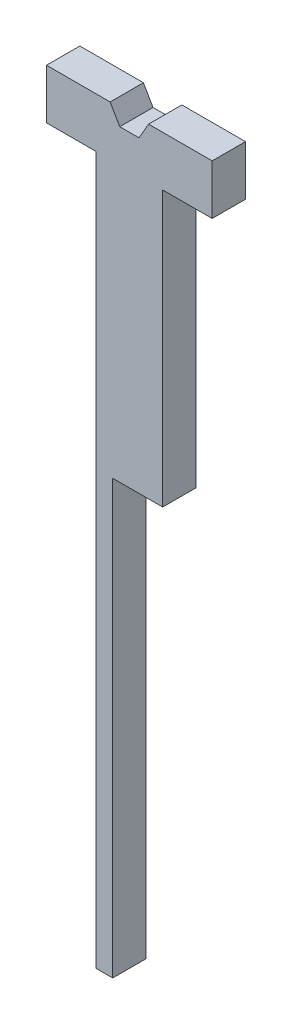
ISO-10303-21;
HEADER;
FILE_DESCRIPTION(('STEP AP214'),'2;1');
FILE_NAME('part.step','',(''),(''),'','','');
FILE_SCHEMA(('AUTOMOTIVE_DESIGN { 1 0 10303 214 1 1 1 1 }'));
ENDSEC;
DATA;
#1=APPLICATION_CONTEXT('core data for automotive mechanical design processes');
#2=APPLICATION_PROTOCOL_DEFINITION('international standard','automotive_design',2000,#1);
#3=PRODUCT_CONTEXT('',#1,'mechanical');
#4=PRODUCT('Part','Part','',(#3));
#5=PRODUCT_RELATED_PRODUCT_CATEGORY('part','',(#4));
#6=PRODUCT_DEFINITION_FORMATION('','',#4);
#7=PRODUCT_DEFINITION_CONTEXT('part definition',#1,'design');
#8=PRODUCT_DEFINITION('design','',#6,#7);
#9=PRODUCT_DEFINITION_SHAPE('','',#8);
#10=(LENGTH_UNIT() NAMED_UNIT(*) SI_UNIT(.MILLI.,.METRE.));
#11=(NAMED_UNIT(*) PLANE_ANGLE_UNIT() SI_UNIT($,.RADIAN.));
#12=(NAMED_UNIT(*) SI_UNIT($,.STERADIAN.) SOLID_ANGLE_UNIT());
#13=UNCERTAINTY_MEASURE_WITH_UNIT(LENGTH_MEASURE(1.E-05),#10,'distance_accuracy_value','');
#14=(GEOMETRIC_REPRESENTATION_CONTEXT(3) GLOBAL_UNCERTAINTY_ASSIGNED_CONTEXT((#13)) GLOBAL_UNIT_ASSIGNED_CONTEXT((#10,
#11,#12)) REPRESENTATION_CONTEXT('',''));
#15=CARTESIAN_POINT('',(0.,0.,0.));
#16=DIRECTION('',(0.,0.,1.));
#17=DIRECTION('',(1.,0.,0.));
#18=AXIS2_PLACEMENT_3D('',#15,#16,#17);
#19=CARTESIAN_POINT('',(0.,-220.,10.));
#20=DIRECTION('',(0.,1.,0.));
#21=DIRECTION('',(0.,0.,1.));
#22=AXIS2_PLACEMENT_3D('',#19,#20,#21);
#23=PLANE('',#22);
#24=DIRECTION('',(0.,0.,-1.));
#25=VECTOR('',#24,1.);
#26=CARTESIAN_POINT('',(-4.99999999999994,-220.,0.));
#27=LINE('',#26,#25);
#28=CARTESIAN_POINT('',(-4.99999999999994,-220.,10.));
#29=VERTEX_POINT('',#28);
#30=CARTESIAN_POINT('',(-4.99999999999996,-220.,0.));
#31=VERTEX_POINT('',#30);
#32=EDGE_CURVE('E50',#29,#31,#27,.T.);
#33=ORIENTED_EDGE('',*,*,#32,.F.);
#34=DIRECTION('',(1.,0.,0.));
#35=VECTOR('',#34,1.);
#36=CARTESIAN_POINT('',(0.,-220.,10.));
#37=LINE('',#36,#35);
#38=CARTESIAN_POINT('',(-9.99999999999997,-220.,10.));
#39=VERTEX_POINT('',#38);
#40=EDGE_CURVE('E108',#39,#29,#37,.T.);
#41=ORIENTED_EDGE('',*,*,#40,.F.);
#42=DIRECTION('',(0.,0.,-1.));
#43=VECTOR('',#42,1.);
#44=CARTESIAN_POINT('',(-9.99999999999997,-220.,10.));
#45=LINE('',#44,#43);
#46=CARTESIAN_POINT('',(-9.99999999999997,-220.,0.));
#47=VERTEX_POINT('',#46);
#48=EDGE_CURVE('E11',#39,#47,#45,.T.);
#49=ORIENTED_EDGE('',*,*,#48,.T.);
#50=DIRECTION('',(1.,0.,0.));
#51=VECTOR('',#50,1.);
#52=CARTESIAN_POINT('',(0.,-220.,0.));
#53=LINE('',#52,#51);
#54=EDGE_CURVE('E168',#47,#31,#53,.T.);
#55=ORIENTED_EDGE('',*,*,#54,.T.);
#56=EDGE_LOOP('',(#33,#41,#49,#55));
#57=FACE_BOUND('',#56,.T.);
#58=ADVANCED_FACE('F35',(#57),#23,.F.);
#59=CARTESIAN_POINT('',(-10.,0.,10.));
#60=DIRECTION('',(1.,0.,0.));
#61=DIRECTION('',(0.,1.,0.));
#62=AXIS2_PLACEMENT_3D('',#59,#60,#61);
#63=PLANE('',#62);
#64=DIRECTION('',(0.,-1.,0.));
#65=VECTOR('',#64,1.);
#66=CARTESIAN_POINT('',(-10.,0.,0.));
#67=LINE('',#66,#65);
#68=CARTESIAN_POINT('',(-10.,-7.5,0.));
#69=VERTEX_POINT('',#68);
#70=EDGE_CURVE('E165',#69,#47,#67,.T.);
#71=ORIENTED_EDGE('',*,*,#70,.T.);
#72=ORIENTED_EDGE('',*,*,#48,.F.);
#73=DIRECTION('',(0.,-1.,0.));
#74=VECTOR('',#73,1.);
#75=CARTESIAN_POINT('',(-10.,0.,10.));
#76=LINE('',#75,#74);
#77=CARTESIAN_POINT('',(-10.,-7.5,10.));
#78=VERTEX_POINT('',#77);
#79=EDGE_CURVE('E195',#78,#39,#76,.T.);
#80=ORIENTED_EDGE('',*,*,#79,.F.);
#81=DIRECTION('',(0.,0.,-1.));
#82=VECTOR('',#81,1.);
#83=CARTESIAN_POINT('',(-10.,-7.5,10.));
#84=LINE('',#83,#82);
#85=EDGE_CURVE('E160',#78,#69,#84,.T.);
#86=ORIENTED_EDGE('',*,*,#85,.T.);
#87=EDGE_LOOP('',(#71,#72,#80,#86));
#88=FACE_BOUND('',#87,.T.);
#89=ADVANCED_FACE('F37',(#88),#63,.F.);
#90=CARTESIAN_POINT('',(10.,0.,10.));
#91=DIRECTION('',(1.,0.,0.));
#92=DIRECTION('',(0.,1.,0.));
#93=AXIS2_PLACEMENT_3D('',#90,#91,#92);
#94=PLANE('',#93);
#95=DIRECTION('',(0.,0.,1.));
#96=VECTOR('',#95,1.);
#97=CARTESIAN_POINT('',(10.,-90.,0.));
#98=LINE('',#97,#96);
#99=CARTESIAN_POINT('',(10.,-90.,0.));
#100=VERTEX_POINT('',#99);
#101=CARTESIAN_POINT('',(10.,-90.,10.));
#102=VERTEX_POINT('',#101);
#103=EDGE_CURVE('E227',#100,#102,#98,.T.);
#104=ORIENTED_EDGE('',*,*,#103,.F.);
#105=DIRECTION('',(0.,-1.,0.));
#106=VECTOR('',#105,1.);
#107=CARTESIAN_POINT('',(10.,0.,0.));
#108=LINE('',#107,#106);
#109=CARTESIAN_POINT('',(10.,-7.5,0.));
#110=VERTEX_POINT('',#109);
#111=EDGE_CURVE('E172',#110,#100,#108,.T.);
#112=ORIENTED_EDGE('',*,*,#111,.F.);
#113=DIRECTION('',(0.,0.,-1.));
#114=VECTOR('',#113,1.);
#115=CARTESIAN_POINT('',(10.,-7.5,10.));
#116=LINE('',#115,#114);
#117=CARTESIAN_POINT('',(10.,-7.5,10.));
#118=VERTEX_POINT('',#117);
#119=EDGE_CURVE('E43',#118,#110,#116,.T.);
#120=ORIENTED_EDGE('',*,*,#119,.F.);
#121=DIRECTION('',(0.,-1.,0.));
#122=VECTOR('',#121,1.);
#123=CARTESIAN_POINT('',(10.,0.,10.));
#124=LINE('',#123,#122);
#125=EDGE_CURVE('E228',#118,#102,#124,.T.);
#126=ORIENTED_EDGE('',*,*,#125,.T.);
#127=EDGE_LOOP('',(#104,#112,#120,#126));
#128=FACE_BOUND('',#127,.T.);
#129=ADVANCED_FACE('F225',(#128),#94,.T.);
#130=CARTESIAN_POINT('',(0.,-7.5,10.));
#131=DIRECTION('',(0.,1.,0.));
#132=DIRECTION('',(0.,0.,1.));
#133=AXIS2_PLACEMENT_3D('',#130,#131,#132);
#134=PLANE('',#133);
#135=DIRECTION('',(1.,0.,0.));
#136=VECTOR('',#135,1.);
#137=CARTESIAN_POINT('',(0.,-7.5,0.));
#138=LINE('',#137,#136);
#139=CARTESIAN_POINT('',(24.875,-7.5,0.));
#140=VERTEX_POINT('',#139);
#141=EDGE_CURVE('E175',#110,#140,#138,.T.);
#142=ORIENTED_EDGE('',*,*,#141,.T.);
#143=DIRECTION('',(0.,0.,-1.));
#144=VECTOR('',#143,1.);
#145=CARTESIAN_POINT('',(24.875,-7.5,10.));
#146=LINE('',#145,#144);
#147=CARTESIAN_POINT('',(24.875,-7.5,10.));
#148=VERTEX_POINT('',#147);
#149=EDGE_CURVE('E207',#148,#140,#146,.T.);
#150=ORIENTED_EDGE('',*,*,#149,.F.);
#151=DIRECTION('',(1.,0.,0.));
#152=VECTOR('',#151,1.);
#153=CARTESIAN_POINT('',(0.,-7.5,10.));
#154=LINE('',#153,#152);
#155=EDGE_CURVE('E214',#118,#148,#154,.T.);
#156=ORIENTED_EDGE('',*,*,#155,.F.);
#157=ORIENTED_EDGE('',*,*,#119,.T.);
#158=EDGE_LOOP('',(#142,#150,#156,#157));
#159=FACE_BOUND('',#158,.T.);
#160=ADVANCED_FACE('F212',(#159),#134,.F.);
#161=CARTESIAN_POINT('',(24.875,0.,10.));
#162=DIRECTION('',(-1.,0.,0.));
#163=DIRECTION('',(0.,-1.,0.));
#164=AXIS2_PLACEMENT_3D('',#161,#162,#163);
#165=PLANE('',#164);
#166=DIRECTION('',(0.,1.,0.));
#167=VECTOR('',#166,1.);
#168=CARTESIAN_POINT('',(24.875,0.,0.));
#169=LINE('',#168,#167);
#170=CARTESIAN_POINT('',(24.875,7.5,0.));
#171=VERTEX_POINT('',#170);
#172=EDGE_CURVE('E177',#140,#171,#169,.T.);
#173=ORIENTED_EDGE('',*,*,#172,.T.);
#174=DIRECTION('',(0.,0.,-1.));
#175=VECTOR('',#174,1.);
#176=CARTESIAN_POINT('',(24.875,7.5,10.));
#177=LINE('',#176,#175);
#178=CARTESIAN_POINT('',(24.875,7.5,10.));
#179=VERTEX_POINT('',#178);
#180=EDGE_CURVE('E205',#179,#171,#177,.T.);
#181=ORIENTED_EDGE('',*,*,#180,.F.);
#182=DIRECTION('',(0.,1.,0.));
#183=VECTOR('',#182,1.);
#184=CARTESIAN_POINT('',(24.875,0.,10.));
#185=LINE('',#184,#183);
#186=EDGE_CURVE('E246',#148,#179,#185,.T.);
#187=ORIENTED_EDGE('',*,*,#186,.F.);
#188=ORIENTED_EDGE('',*,*,#149,.T.);
#189=EDGE_LOOP('',(#173,#181,#187,#188));
#190=FACE_BOUND('',#189,.T.);
#191=ADVANCED_FACE('F281',(#190),#165,.F.);
#192=CARTESIAN_POINT('',(0.,7.5,10.));
#193=DIRECTION('',(0.,1.,0.));
#194=DIRECTION('',(0.,0.,1.));
#195=AXIS2_PLACEMENT_3D('',#192,#193,#194);
#196=PLANE('',#195);
#197=DIRECTION('',(1.,0.,0.));
#198=VECTOR('',#197,1.);
#199=CARTESIAN_POINT('',(0.,7.5,0.));
#200=LINE('',#199,#198);
#201=CARTESIAN_POINT('',(5.77350269189626,7.5,0.));
#202=VERTEX_POINT('',#201);
#203=EDGE_CURVE('E180',#202,#171,#200,.T.);
#204=ORIENTED_EDGE('',*,*,#203,.F.);
#205=DIRECTION('',(0.,0.,-1.));
#206=VECTOR('',#205,1.);
#207=CARTESIAN_POINT('',(5.77350269189626,7.5,10.));
#208=LINE('',#207,#206);
#209=CARTESIAN_POINT('',(5.77350269189626,7.5,10.));
#210=VERTEX_POINT('',#209);
#211=EDGE_CURVE('E203',#210,#202,#208,.T.);
#212=ORIENTED_EDGE('',*,*,#211,.F.);
#213=DIRECTION('',(1.,0.,0.));
#214=VECTOR('',#213,1.);
#215=CARTESIAN_POINT('',(0.,7.5,10.));
#216=LINE('',#215,#214);
#217=EDGE_CURVE('E157',#210,#179,#216,.T.);
#218=ORIENTED_EDGE('',*,*,#217,.T.);
#219=ORIENTED_EDGE('',*,*,#180,.T.);
#220=EDGE_LOOP('',(#204,#212,#218,#219));
#221=FACE_BOUND('',#220,.T.);
#222=ADVANCED_FACE('F284',(#221),#196,.T.);
#223=CARTESIAN_POINT('',(1.08253175473055,-0.624999999999999,10.));
#224=DIRECTION('',(-0.866025403784439,0.5,0.));
#225=DIRECTION('',(-0.5,-0.866025403784439,0.));
#226=AXIS2_PLACEMENT_3D('',#223,#224,#225);
#227=PLANE('',#226);
#228=DIRECTION('',(0.5,0.866025403784439,0.));
#229=VECTOR('',#228,1.);
#230=CARTESIAN_POINT('',(1.08253175473055,-0.624999999999999,0.));
#231=LINE('',#230,#229);
#232=CARTESIAN_POINT('',(2.88675134594813,2.50000000000001,0.));
#233=VERTEX_POINT('',#232);
#234=EDGE_CURVE('E183',#233,#202,#231,.T.);
#235=ORIENTED_EDGE('',*,*,#234,.F.);
#236=DIRECTION('',(0.,0.,-1.));
#237=VECTOR('',#236,1.);
#238=CARTESIAN_POINT('',(2.88675134594813,2.50000000000001,10.));
#239=LINE('',#238,#237);
#240=CARTESIAN_POINT('',(2.88675134594813,2.50000000000001,10.));
#241=VERTEX_POINT('',#240);
#242=EDGE_CURVE('E201',#241,#233,#239,.T.);
#243=ORIENTED_EDGE('',*,*,#242,.F.);
#244=DIRECTION('',(0.5,0.866025403784439,0.));
#245=VECTOR('',#244,1.);
#246=CARTESIAN_POINT('',(1.08253175473055,-0.624999999999999,10.));
#247=LINE('',#246,#245);
#248=EDGE_CURVE('E249',#241,#210,#247,.T.);
#249=ORIENTED_EDGE('',*,*,#248,.T.);
#250=ORIENTED_EDGE('',*,*,#211,.T.);
#251=EDGE_LOOP('',(#235,#243,#249,#250));
#252=FACE_BOUND('',#251,.T.);
#253=ADVANCED_FACE('F286',(#252),#227,.T.);
#254=CARTESIAN_POINT('',(0.,2.50000000000001,10.));
#255=DIRECTION('',(0.,1.,0.));
#256=DIRECTION('',(-1.,0.,0.));
#257=AXIS2_PLACEMENT_3D('',#254,#255,#256);
#258=PLANE('',#257);
#259=DIRECTION('',(1.,0.,0.));
#260=VECTOR('',#259,1.);
#261=CARTESIAN_POINT('',(0.,2.50000000000001,0.));
#262=LINE('',#261,#260);
#263=CARTESIAN_POINT('',(-2.88675134594813,2.50000000000001,0.));
#264=VERTEX_POINT('',#263);
#265=EDGE_CURVE('E186',#264,#233,#262,.T.);
#266=ORIENTED_EDGE('',*,*,#265,.F.);
#267=DIRECTION('',(0.,0.,-1.));
#268=VECTOR('',#267,1.);
#269=CARTESIAN_POINT('',(-2.88675134594813,2.50000000000001,10.));
#270=LINE('',#269,#268);
#271=CARTESIAN_POINT('',(-2.88675134594813,2.50000000000001,10.));
#272=VERTEX_POINT('',#271);
#273=EDGE_CURVE('E199',#272,#264,#270,.T.);
#274=ORIENTED_EDGE('',*,*,#273,.F.);
#275=DIRECTION('',(1.,0.,0.));
#276=VECTOR('',#275,1.);
#277=CARTESIAN_POINT('',(0.,2.50000000000001,10.));
#278=LINE('',#277,#276);
#279=EDGE_CURVE('E251',#272,#241,#278,.T.);
#280=ORIENTED_EDGE('',*,*,#279,.T.);
#281=ORIENTED_EDGE('',*,*,#242,.T.);
#282=EDGE_LOOP('',(#266,#274,#280,#281));
#283=FACE_BOUND('',#282,.T.);
#284=ADVANCED_FACE('F289',(#283),#258,.T.);
#285=CARTESIAN_POINT('',(-1.08253175473055,-0.624999999999999,10.));
#286=DIRECTION('',(0.866025403784439,0.5,0.));
#287=DIRECTION('',(-0.5,0.866025403784439,0.));
#288=AXIS2_PLACEMENT_3D('',#285,#286,#287);
#289=PLANE('',#288);
#290=DIRECTION('',(0.5,-0.866025403784439,0.));
#291=VECTOR('',#290,1.);
#292=CARTESIAN_POINT('',(-1.08253175473055,-0.624999999999999,0.));
#293=LINE('',#292,#291);
#294=CARTESIAN_POINT('',(-5.77350269189626,7.5,0.));
#295=VERTEX_POINT('',#294);
#296=EDGE_CURVE('E189',#295,#264,#293,.T.);
#297=ORIENTED_EDGE('',*,*,#296,.F.);
#298=DIRECTION('',(0.,0.,-1.));
#299=VECTOR('',#298,1.);
#300=CARTESIAN_POINT('',(-5.77350269189626,7.5,10.));
#301=LINE('',#300,#299);
#302=CARTESIAN_POINT('',(-5.77350269189626,7.5,10.));
#303=VERTEX_POINT('',#302);
#304=EDGE_CURVE('E146',#303,#295,#301,.T.);
#305=ORIENTED_EDGE('',*,*,#304,.F.);
#306=DIRECTION('',(0.5,-0.866025403784439,0.));
#307=VECTOR('',#306,1.);
#308=CARTESIAN_POINT('',(-1.08253175473055,-0.624999999999999,10.));
#309=LINE('',#308,#307);
#310=EDGE_CURVE('E155',#303,#272,#309,.T.);
#311=ORIENTED_EDGE('',*,*,#310,.T.);
#312=ORIENTED_EDGE('',*,*,#273,.T.);
#313=EDGE_LOOP('',(#297,#305,#311,#312));
#314=FACE_BOUND('',#313,.T.);
#315=ADVANCED_FACE('F256',(#314),#289,.T.);
#316=CARTESIAN_POINT('',(-24.875,7.5,0.));
#317=VERTEX_POINT('',#316);
#318=EDGE_CURVE('E141',#317,#295,#200,.T.);
#319=ORIENTED_EDGE('',*,*,#318,.F.);
#320=DIRECTION('',(0.,0.,-1.));
#321=VECTOR('',#320,1.);
#322=CARTESIAN_POINT('',(-24.875,7.5,10.));
#323=LINE('',#322,#321);
#324=CARTESIAN_POINT('',(-24.875,7.5,10.));
#325=VERTEX_POINT('',#324);
#326=EDGE_CURVE('E136',#325,#317,#323,.T.);
#327=ORIENTED_EDGE('',*,*,#326,.F.);
#328=EDGE_CURVE('E139',#325,#303,#216,.T.);
#329=ORIENTED_EDGE('',*,*,#328,.T.);
#330=ORIENTED_EDGE('',*,*,#304,.T.);
#331=EDGE_LOOP('',(#319,#327,#329,#330));
#332=FACE_BOUND('',#331,.T.);
#333=ADVANCED_FACE('F138',(#332),#196,.T.);
#334=CARTESIAN_POINT('',(-24.875,0.,10.));
#335=DIRECTION('',(-1.,0.,0.));
#336=DIRECTION('',(0.,-1.,0.));
#337=AXIS2_PLACEMENT_3D('',#334,#335,#336);
#338=PLANE('',#337);
#339=DIRECTION('',(0.,1.,0.));
#340=VECTOR('',#339,1.);
#341=CARTESIAN_POINT('',(-24.875,0.,0.));
#342=LINE('',#341,#340);
#343=CARTESIAN_POINT('',(-24.875,-7.5,0.));
#344=VERTEX_POINT('',#343);
#345=EDGE_CURVE('E192',#344,#317,#342,.T.);
#346=ORIENTED_EDGE('',*,*,#345,.F.);
#347=DIRECTION('',(0.,0.,-1.));
#348=VECTOR('',#347,1.);
#349=CARTESIAN_POINT('',(-24.875,-7.5,10.));
#350=LINE('',#349,#348);
#351=CARTESIAN_POINT('',(-24.875,-7.5,10.));
#352=VERTEX_POINT('',#351);
#353=EDGE_CURVE('E147',#352,#344,#350,.T.);
#354=ORIENTED_EDGE('',*,*,#353,.F.);
#355=DIRECTION('',(0.,1.,0.));
#356=VECTOR('',#355,1.);
#357=CARTESIAN_POINT('',(-24.875,0.,10.));
#358=LINE('',#357,#356);
#359=EDGE_CURVE('E152',#352,#325,#358,.T.);
#360=ORIENTED_EDGE('',*,*,#359,.T.);
#361=ORIENTED_EDGE('',*,*,#326,.T.);
#362=EDGE_LOOP('',(#346,#354,#360,#361));
#363=FACE_BOUND('',#362,.T.);
#364=ADVANCED_FACE('F158',(#363),#338,.T.);
#365=CARTESIAN_POINT('',(0.,-7.5,10.));
#366=DIRECTION('',(0.,1.,0.));
#367=DIRECTION('',(0.,0.,1.));
#368=AXIS2_PLACEMENT_3D('',#365,#366,#367);
#369=PLANE('',#368);
#370=DIRECTION('',(1.,0.,0.));
#371=VECTOR('',#370,1.);
#372=CARTESIAN_POINT('',(0.,-7.5,0.));
#373=LINE('',#372,#371);
#374=EDGE_CURVE('E101',#344,#69,#373,.T.);
#375=ORIENTED_EDGE('',*,*,#374,.T.);
#376=ORIENTED_EDGE('',*,*,#85,.F.);
#377=DIRECTION('',(1.,0.,0.));
#378=VECTOR('',#377,1.);
#379=CARTESIAN_POINT('',(0.,-7.5,10.));
#380=LINE('',#379,#378);
#381=EDGE_CURVE('E59',#352,#78,#380,.T.);
#382=ORIENTED_EDGE('',*,*,#381,.F.);
#383=ORIENTED_EDGE('',*,*,#353,.T.);
#384=EDGE_LOOP('',(#375,#376,#382,#383));
#385=FACE_BOUND('',#384,.T.);
#386=ADVANCED_FACE('F262',(#385),#369,.F.);
#387=CARTESIAN_POINT('',(0.,0.,10.));
#388=DIRECTION('',(0.,0.,1.));
#389=DIRECTION('',(1.,0.,0.));
#390=AXIS2_PLACEMENT_3D('',#387,#388,#389);
#391=PLANE('',#390);
#392=DIRECTION('',(1.,0.,0.));
#393=VECTOR('',#392,1.);
#394=CARTESIAN_POINT('',(-4.99999999999997,-90.,10.));
#395=LINE('',#394,#393);
#396=CARTESIAN_POINT('',(-4.99999999999997,-90.,10.));
#397=VERTEX_POINT('',#396);
#398=EDGE_CURVE('E169',#397,#102,#395,.T.);
#399=ORIENTED_EDGE('',*,*,#398,.T.);
#400=ORIENTED_EDGE('',*,*,#125,.F.);
#401=ORIENTED_EDGE('',*,*,#155,.T.);
#402=ORIENTED_EDGE('',*,*,#186,.T.);
#403=ORIENTED_EDGE('',*,*,#217,.F.);
#404=ORIENTED_EDGE('',*,*,#248,.F.);
#405=ORIENTED_EDGE('',*,*,#279,.F.);
#406=ORIENTED_EDGE('',*,*,#310,.F.);
#407=ORIENTED_EDGE('',*,*,#328,.F.);
#408=ORIENTED_EDGE('',*,*,#359,.F.);
#409=ORIENTED_EDGE('',*,*,#381,.T.);
#410=ORIENTED_EDGE('',*,*,#79,.T.);
#411=ORIENTED_EDGE('',*,*,#40,.T.);
#412=DIRECTION('',(0.,-1.,0.));
#413=VECTOR('',#412,1.);
#414=CARTESIAN_POINT('',(-4.99999999999994,-220.,10.));
#415=LINE('',#414,#413);
#416=EDGE_CURVE('E310',#397,#29,#415,.T.);
#417=ORIENTED_EDGE('',*,*,#416,.F.);
#418=EDGE_LOOP('',(#399,#400,#401,#402,#403,#404,#405,#406,#407,#408,#409,#410,#411,#417));
#419=FACE_BOUND('',#418,.T.);
#420=ADVANCED_FACE('F151',(#419),#391,.T.);
#421=CARTESIAN_POINT('',(0.,0.,0.));
#422=DIRECTION('',(0.,0.,1.));
#423=DIRECTION('',(1.,0.,0.));
#424=AXIS2_PLACEMENT_3D('',#421,#422,#423);
#425=PLANE('',#424);
#426=ORIENTED_EDGE('',*,*,#111,.T.);
#427=DIRECTION('',(1.,0.,0.));
#428=VECTOR('',#427,1.);
#429=CARTESIAN_POINT('',(-4.99999999999997,-90.,0.));
#430=LINE('',#429,#428);
#431=CARTESIAN_POINT('',(-4.99999999999997,-90.,0.));
#432=VERTEX_POINT('',#431);
#433=EDGE_CURVE('E240',#432,#100,#430,.T.);
#434=ORIENTED_EDGE('',*,*,#433,.F.);
#435=DIRECTION('',(0.,1.,0.));
#436=VECTOR('',#435,1.);
#437=CARTESIAN_POINT('',(-4.99999999999994,-220.,0.));
#438=LINE('',#437,#436);
#439=EDGE_CURVE('E232',#31,#432,#438,.T.);
#440=ORIENTED_EDGE('',*,*,#439,.F.);
#441=ORIENTED_EDGE('',*,*,#54,.F.);
#442=ORIENTED_EDGE('',*,*,#70,.F.);
#443=ORIENTED_EDGE('',*,*,#374,.F.);
#444=ORIENTED_EDGE('',*,*,#345,.T.);
#445=ORIENTED_EDGE('',*,*,#318,.T.);
#446=ORIENTED_EDGE('',*,*,#296,.T.);
#447=ORIENTED_EDGE('',*,*,#265,.T.);
#448=ORIENTED_EDGE('',*,*,#234,.T.);
#449=ORIENTED_EDGE('',*,*,#203,.T.);
#450=ORIENTED_EDGE('',*,*,#172,.F.);
#451=ORIENTED_EDGE('',*,*,#141,.F.);
#452=EDGE_LOOP('',(#426,#434,#440,#441,#442,#443,#444,#445,#446,#447,#448,#449,#450,#451));
#453=FACE_BOUND('',#452,.T.);
#454=ADVANCED_FACE('F221',(#453),#425,.F.);
#455=CARTESIAN_POINT('',(-4.99999999999997,-90.,0.));
#456=DIRECTION('',(0.,1.,0.));
#457=DIRECTION('',(-1.,0.,0.));
#458=AXIS2_PLACEMENT_3D('',#455,#456,#457);
#459=PLANE('',#458);
#460=ORIENTED_EDGE('',*,*,#103,.T.);
#461=ORIENTED_EDGE('',*,*,#398,.F.);
#462=DIRECTION('',(0.,0.,1.));
#463=VECTOR('',#462,1.);
#464=CARTESIAN_POINT('',(-4.99999999999997,-90.,0.));
#465=LINE('',#464,#463);
#466=EDGE_CURVE('E234',#432,#397,#465,.T.);
#467=ORIENTED_EDGE('',*,*,#466,.F.);
#468=ORIENTED_EDGE('',*,*,#433,.T.);
#469=EDGE_LOOP('',(#460,#461,#467,#468));
#470=FACE_BOUND('',#469,.T.);
#471=ADVANCED_FACE('F314',(#470),#459,.F.);
#472=CARTESIAN_POINT('',(-5.,0.,0.));
#473=DIRECTION('',(1.,0.,0.));
#474=DIRECTION('',(0.,1.,0.));
#475=AXIS2_PLACEMENT_3D('',#472,#473,#474);
#476=PLANE('',#475);
#477=ORIENTED_EDGE('',*,*,#439,.T.);
#478=ORIENTED_EDGE('',*,*,#466,.T.);
#479=ORIENTED_EDGE('',*,*,#416,.T.);
#480=ORIENTED_EDGE('',*,*,#32,.T.);
#481=EDGE_LOOP('',(#477,#478,#479,#480));
#482=FACE_BOUND('',#481,.T.);
#483=ADVANCED_FACE('F316',(#482),#476,.T.);
#484=CLOSED_SHELL('',(#58,#89,#129,#160,#191,#222,#253,#284,#315,#333,#364,#386,#420,#454,#471,#483));
#485=MANIFOLD_SOLID_BREP('B2',#484);
#486=ADVANCED_BREP_SHAPE_REPRESENTATION('',(#18,#485),#14);
#487=SHAPE_DEFINITION_REPRESENTATION(#9,#486);
ENDSEC;
END-ISO-10303-21;
